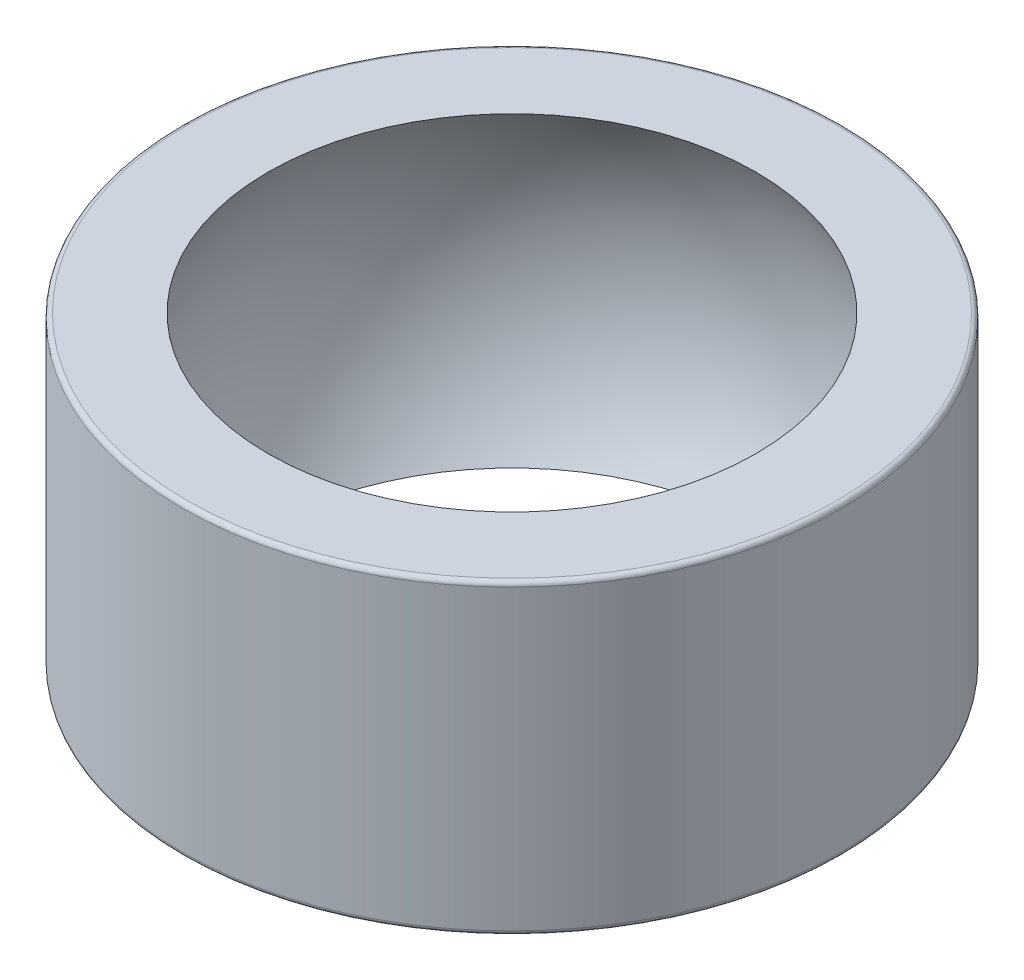
ISO-10303-21;
HEADER;
FILE_DESCRIPTION(('STEP AP214'),'2;1');
FILE_NAME('part.step','',(''),(''),'','','');
FILE_SCHEMA(('AUTOMOTIVE_DESIGN { 1 0 10303 214 1 1 1 1 }'));
ENDSEC;
DATA;
#1=APPLICATION_CONTEXT('core data for automotive mechanical design processes');
#2=APPLICATION_PROTOCOL_DEFINITION('international standard','automotive_design',2000,#1);
#3=PRODUCT_CONTEXT('',#1,'mechanical');
#4=PRODUCT('Part','Part','',(#3));
#5=PRODUCT_RELATED_PRODUCT_CATEGORY('part','',(#4));
#6=PRODUCT_DEFINITION_FORMATION('','',#4);
#7=PRODUCT_DEFINITION_CONTEXT('part definition',#1,'design');
#8=PRODUCT_DEFINITION('design','',#6,#7);
#9=PRODUCT_DEFINITION_SHAPE('','',#8);
#10=(LENGTH_UNIT() NAMED_UNIT(*) SI_UNIT(.MILLI.,.METRE.));
#11=(NAMED_UNIT(*) PLANE_ANGLE_UNIT() SI_UNIT($,.RADIAN.));
#12=(NAMED_UNIT(*) SI_UNIT($,.STERADIAN.) SOLID_ANGLE_UNIT());
#13=UNCERTAINTY_MEASURE_WITH_UNIT(LENGTH_MEASURE(1.E-05),#10,'distance_accuracy_value','');
#14=(GEOMETRIC_REPRESENTATION_CONTEXT(3) GLOBAL_UNCERTAINTY_ASSIGNED_CONTEXT((#13)) GLOBAL_UNIT_ASSIGNED_CONTEXT((#10,
#11,#12)) REPRESENTATION_CONTEXT('',''));
#15=CARTESIAN_POINT('',(0.,0.,0.));
#16=DIRECTION('',(0.,0.,1.));
#17=DIRECTION('',(1.,0.,0.));
#18=AXIS2_PLACEMENT_3D('',#15,#16,#17);
#19=CARTESIAN_POINT('',(0.,6.75,0.));
#20=DIRECTION('',(0.,-1.,0.));
#21=DIRECTION('',(0.,0.,-1.));
#22=AXIS2_PLACEMENT_3D('',#19,#20,#21);
#23=CYLINDRICAL_SURFACE('',#22,14.5);
#24=CARTESIAN_POINT('',(0.,-6.55,0.));
#25=DIRECTION('',(0.,1.,0.));
#26=DIRECTION('',(0.,0.,1.));
#27=AXIS2_PLACEMENT_3D('',#24,#25,#26);
#28=CIRCLE('',#27,14.5);
#29=CARTESIAN_POINT('',(0.,-6.55,14.5));
#30=VERTEX_POINT('',#29);
#31=EDGE_CURVE('E42',#30,#30,#28,.T.);
#32=ORIENTED_EDGE('',*,*,#31,.T.);
#33=EDGE_LOOP('',(#32));
#34=FACE_BOUND('',#33,.T.);
#35=CARTESIAN_POINT('',(0.,6.55,0.));
#36=DIRECTION('',(0.,1.,0.));
#37=DIRECTION('',(0.,0.,1.));
#38=AXIS2_PLACEMENT_3D('',#35,#36,#37);
#39=CIRCLE('',#38,14.5);
#40=CARTESIAN_POINT('',(0.,6.55,14.5));
#41=VERTEX_POINT('',#40);
#42=EDGE_CURVE('E46',#41,#41,#39,.F.);
#43=ORIENTED_EDGE('',*,*,#42,.T.);
#44=EDGE_LOOP('',(#43));
#45=FACE_BOUND('',#44,.T.);
#46=ADVANCED_FACE('F31',(#34,#45),#23,.T.);
#47=CARTESIAN_POINT('',(0.,6.75,0.));
#48=DIRECTION('',(0.,1.,0.));
#49=DIRECTION('',(0.,0.,1.));
#50=AXIS2_PLACEMENT_3D('',#47,#48,#49);
#51=PLANE('',#50);
#52=CARTESIAN_POINT('',(0.,6.75,0.));
#53=DIRECTION('',(0.,1.,0.));
#54=DIRECTION('',(0.,0.,1.));
#55=AXIS2_PLACEMENT_3D('',#52,#53,#54);
#56=CIRCLE('',#55,14.3);
#57=CARTESIAN_POINT('',(0.,6.75,14.3));
#58=VERTEX_POINT('',#57);
#59=EDGE_CURVE('E10',#58,#58,#56,.T.);
#60=ORIENTED_EDGE('',*,*,#59,.T.);
#61=EDGE_LOOP('',(#60));
#62=FACE_BOUND('',#61,.T.);
#63=CARTESIAN_POINT('',(0.,6.75,0.));
#64=DIRECTION('',(0.,1.,0.));
#65=DIRECTION('',(0.,0.,1.));
#66=AXIS2_PLACEMENT_3D('',#63,#64,#65);
#67=CIRCLE('',#66,10.7340532884833);
#68=CARTESIAN_POINT('',(0.,6.75,10.7340532884833));
#69=VERTEX_POINT('',#68);
#70=EDGE_CURVE('E51',#69,#69,#67,.T.);
#71=ORIENTED_EDGE('',*,*,#70,.F.);
#72=EDGE_LOOP('',(#71));
#73=FACE_BOUND('',#72,.T.);
#74=ADVANCED_FACE('F61',(#62,#73),#51,.T.);
#75=CARTESIAN_POINT('',(0.,-6.75,0.));
#76=DIRECTION('',(0.,1.,0.));
#77=DIRECTION('',(0.,0.,1.));
#78=AXIS2_PLACEMENT_3D('',#75,#76,#77);
#79=PLANE('',#78);
#80=CARTESIAN_POINT('',(0.,-6.75,0.));
#81=DIRECTION('',(0.,1.,0.));
#82=DIRECTION('',(0.,0.,1.));
#83=AXIS2_PLACEMENT_3D('',#80,#81,#82);
#84=CIRCLE('',#83,14.3);
#85=CARTESIAN_POINT('',(0.,-6.75,14.3));
#86=VERTEX_POINT('',#85);
#87=EDGE_CURVE('E38',#86,#86,#84,.F.);
#88=ORIENTED_EDGE('',*,*,#87,.T.);
#89=EDGE_LOOP('',(#88));
#90=FACE_BOUND('',#89,.T.);
#91=CARTESIAN_POINT('',(0.,-6.75,0.));
#92=DIRECTION('',(0.,1.,0.));
#93=DIRECTION('',(0.,0.,1.));
#94=AXIS2_PLACEMENT_3D('',#91,#92,#93);
#95=CIRCLE('',#94,10.7340532884833);
#96=CARTESIAN_POINT('',(0.,-6.75,10.7340532884833));
#97=VERTEX_POINT('',#96);
#98=EDGE_CURVE('E52',#97,#97,#95,.T.);
#99=ORIENTED_EDGE('',*,*,#98,.T.);
#100=EDGE_LOOP('',(#99));
#101=FACE_BOUND('',#100,.T.);
#102=ADVANCED_FACE('F63',(#90,#101),#79,.F.);
#103=CARTESIAN_POINT('',(0.,0.,0.));
#104=DIRECTION('',(0.,-1.,0.));
#105=DIRECTION('',(-1.,0.,0.));
#106=AXIS2_PLACEMENT_3D('',#103,#104,#105);
#107=SPHERICAL_SURFACE('',#106,12.68);
#108=ORIENTED_EDGE('',*,*,#70,.T.);
#109=EDGE_LOOP('',(#108));
#110=FACE_BOUND('',#109,.T.);
#111=ORIENTED_EDGE('',*,*,#98,.F.);
#112=EDGE_LOOP('',(#111));
#113=FACE_BOUND('',#112,.T.);
#114=ADVANCED_FACE('F58',(#110,#113),#107,.F.);
#115=CARTESIAN_POINT('',(0.,-6.55,0.));
#116=DIRECTION('',(0.,1.,0.));
#117=DIRECTION('',(0.,0.,1.));
#118=AXIS2_PLACEMENT_3D('',#115,#116,#117);
#119=TOROIDAL_SURFACE('',#118,14.3,0.2);
#120=ORIENTED_EDGE('',*,*,#87,.F.);
#121=EDGE_LOOP('',(#120));
#122=FACE_BOUND('',#121,.T.);
#123=ORIENTED_EDGE('',*,*,#31,.F.);
#124=EDGE_LOOP('',(#123));
#125=FACE_BOUND('',#124,.T.);
#126=ADVANCED_FACE('F73',(#122,#125),#119,.T.);
#127=CARTESIAN_POINT('',(0.,6.55,0.));
#128=DIRECTION('',(0.,1.,0.));
#129=DIRECTION('',(0.,0.,1.));
#130=AXIS2_PLACEMENT_3D('',#127,#128,#129);
#131=TOROIDAL_SURFACE('',#130,14.3,0.2);
#132=ORIENTED_EDGE('',*,*,#42,.F.);
#133=EDGE_LOOP('',(#132));
#134=FACE_BOUND('',#133,.T.);
#135=ORIENTED_EDGE('',*,*,#59,.F.);
#136=EDGE_LOOP('',(#135));
#137=FACE_BOUND('',#136,.T.);
#138=ADVANCED_FACE('F33',(#134,#137),#131,.T.);
#139=CLOSED_SHELL('',(#46,#74,#102,#114,#126,#138));
#140=MANIFOLD_SOLID_BREP('B2',#139);
#141=ADVANCED_BREP_SHAPE_REPRESENTATION('',(#18,#140),#14);
#142=SHAPE_DEFINITION_REPRESENTATION(#9,#141);
ENDSEC;
END-ISO-10303-21;
